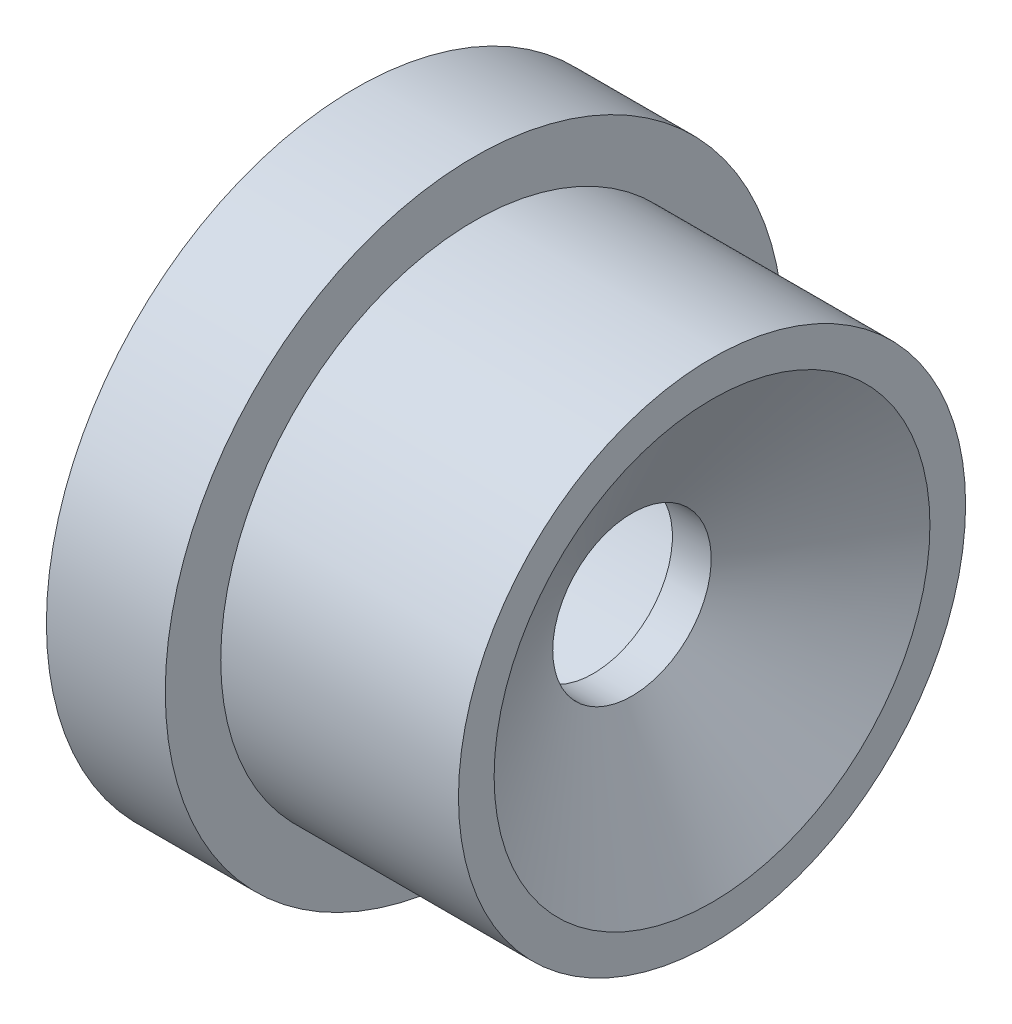
ISO-10303-21;
HEADER;
FILE_DESCRIPTION(('STEP AP214'),'2;1');
FILE_NAME('part.step','',(''),(''),'','','');
FILE_SCHEMA(('AUTOMOTIVE_DESIGN { 1 0 10303 214 1 1 1 1 }'));
ENDSEC;
DATA;
#1=APPLICATION_CONTEXT('core data for automotive mechanical design processes');
#2=APPLICATION_PROTOCOL_DEFINITION('international standard','automotive_design',2000,#1);
#3=PRODUCT_CONTEXT('',#1,'mechanical');
#4=PRODUCT('Part','Part','',(#3));
#5=PRODUCT_RELATED_PRODUCT_CATEGORY('part','',(#4));
#6=PRODUCT_DEFINITION_FORMATION('','',#4);
#7=PRODUCT_DEFINITION_CONTEXT('part definition',#1,'design');
#8=PRODUCT_DEFINITION('design','',#6,#7);
#9=PRODUCT_DEFINITION_SHAPE('','',#8);
#10=(LENGTH_UNIT() NAMED_UNIT(*) SI_UNIT(.MILLI.,.METRE.));
#11=(NAMED_UNIT(*) PLANE_ANGLE_UNIT() SI_UNIT($,.RADIAN.));
#12=(NAMED_UNIT(*) SI_UNIT($,.STERADIAN.) SOLID_ANGLE_UNIT());
#13=UNCERTAINTY_MEASURE_WITH_UNIT(LENGTH_MEASURE(1.E-05),#10,'distance_accuracy_value','');
#14=(GEOMETRIC_REPRESENTATION_CONTEXT(3) GLOBAL_UNCERTAINTY_ASSIGNED_CONTEXT((#13)) GLOBAL_UNIT_ASSIGNED_CONTEXT((#10,
#11,#12)) REPRESENTATION_CONTEXT('',''));
#15=CARTESIAN_POINT('',(0.,0.,0.));
#16=DIRECTION('',(0.,0.,1.));
#17=DIRECTION('',(1.,0.,0.));
#18=AXIS2_PLACEMENT_3D('',#15,#16,#17);
#19=CARTESIAN_POINT('',(0.,3.9,0.));
#20=DIRECTION('',(1.,0.,0.));
#21=DIRECTION('',(0.,0.,-1.));
#22=AXIS2_PLACEMENT_3D('',#19,#20,#21);
#23=PLANE('',#22);
#24=CARTESIAN_POINT('',(0.,0.,0.));
#25=DIRECTION('',(-1.,0.,0.));
#26=DIRECTION('',(0.,0.,1.));
#27=AXIS2_PLACEMENT_3D('',#24,#25,#26);
#28=CIRCLE('',#27,2.25);
#29=CARTESIAN_POINT('',(0.,0.,2.25));
#30=VERTEX_POINT('',#29);
#31=EDGE_CURVE('E10',#30,#30,#28,.T.);
#32=ORIENTED_EDGE('',*,*,#31,.F.);
#33=EDGE_LOOP('',(#32));
#34=FACE_BOUND('',#33,.T.);
#35=CARTESIAN_POINT('',(0.,0.,0.));
#36=DIRECTION('',(-1.,0.,0.));
#37=DIRECTION('',(0.,0.,1.));
#38=AXIS2_PLACEMENT_3D('',#35,#36,#37);
#39=CIRCLE('',#38,3.9);
#40=CARTESIAN_POINT('',(0.,0.,3.9));
#41=VERTEX_POINT('',#40);
#42=EDGE_CURVE('E64',#41,#41,#39,.T.);
#43=ORIENTED_EDGE('',*,*,#42,.T.);
#44=EDGE_LOOP('',(#43));
#45=FACE_BOUND('',#44,.T.);
#46=ADVANCED_FACE('F33',(#34,#45),#23,.F.);
#47=CARTESIAN_POINT('',(0.,0.,0.));
#48=DIRECTION('',(-1.,0.,0.));
#49=DIRECTION('',(0.,0.,1.));
#50=AXIS2_PLACEMENT_3D('',#47,#48,#49);
#51=CYLINDRICAL_SURFACE('',#50,2.25);
#52=CARTESIAN_POINT('',(3.,0.,0.));
#53=DIRECTION('',(-1.,0.,0.));
#54=DIRECTION('',(0.,0.,1.));
#55=AXIS2_PLACEMENT_3D('',#52,#53,#54);
#56=CIRCLE('',#55,2.25);
#57=CARTESIAN_POINT('',(3.,0.,2.25));
#58=VERTEX_POINT('',#57);
#59=EDGE_CURVE('E39',#58,#58,#56,.T.);
#60=ORIENTED_EDGE('',*,*,#59,.F.);
#61=EDGE_LOOP('',(#60));
#62=FACE_BOUND('',#61,.T.);
#63=ORIENTED_EDGE('',*,*,#31,.T.);
#64=EDGE_LOOP('',(#63));
#65=FACE_BOUND('',#64,.T.);
#66=ADVANCED_FACE('F107',(#62,#65),#51,.F.);
#67=CARTESIAN_POINT('',(3.,2.25,0.));
#68=DIRECTION('',(1.,0.,0.));
#69=DIRECTION('',(0.,0.,-1.));
#70=AXIS2_PLACEMENT_3D('',#67,#68,#69);
#71=PLANE('',#70);
#72=CARTESIAN_POINT('',(3.,0.,0.));
#73=DIRECTION('',(-1.,0.,0.));
#74=DIRECTION('',(0.,0.,1.));
#75=AXIS2_PLACEMENT_3D('',#72,#73,#74);
#76=CIRCLE('',#75,1.);
#77=CARTESIAN_POINT('',(3.,0.,1.));
#78=VERTEX_POINT('',#77);
#79=EDGE_CURVE('E43',#78,#78,#76,.T.);
#80=ORIENTED_EDGE('',*,*,#79,.F.);
#81=EDGE_LOOP('',(#80));
#82=FACE_BOUND('',#81,.T.);
#83=ORIENTED_EDGE('',*,*,#59,.T.);
#84=EDGE_LOOP('',(#83));
#85=FACE_BOUND('',#84,.T.);
#86=ADVANCED_FACE('F102',(#82,#85),#71,.F.);
#87=CARTESIAN_POINT('',(0.,0.,0.));
#88=DIRECTION('',(-1.,0.,0.));
#89=DIRECTION('',(0.,0.,1.));
#90=AXIS2_PLACEMENT_3D('',#87,#88,#89);
#91=CYLINDRICAL_SURFACE('',#90,1.);
#92=CARTESIAN_POINT('',(3.48963702891816,0.,0.));
#93=DIRECTION('',(-1.,0.,0.));
#94=DIRECTION('',(0.,0.,1.));
#95=AXIS2_PLACEMENT_3D('',#92,#93,#94);
#96=CIRCLE('',#95,1.);
#97=CARTESIAN_POINT('',(3.48963702891816,0.,1.));
#98=VERTEX_POINT('',#97);
#99=EDGE_CURVE('E47',#98,#98,#96,.T.);
#100=ORIENTED_EDGE('',*,*,#99,.F.);
#101=EDGE_LOOP('',(#100));
#102=FACE_BOUND('',#101,.T.);
#103=ORIENTED_EDGE('',*,*,#79,.T.);
#104=EDGE_LOOP('',(#103));
#105=FACE_BOUND('',#104,.T.);
#106=ADVANCED_FACE('F96',(#102,#105),#91,.F.);
#107=CARTESIAN_POINT('',(3.48963702891816,0.,0.));
#108=DIRECTION('',(1.,0.,0.));
#109=DIRECTION('',(0.,0.,-1.));
#110=AXIS2_PLACEMENT_3D('',#107,#108,#109);
#111=CONICAL_SURFACE('',#110,1.,1.0471975511966);
#112=CARTESIAN_POINT('',(4.5,0.,0.));
#113=DIRECTION('',(-1.,0.,0.));
#114=DIRECTION('',(0.,0.,1.));
#115=AXIS2_PLACEMENT_3D('',#112,#113,#114);
#116=CIRCLE('',#115,2.75);
#117=CARTESIAN_POINT('',(4.5,0.,2.75));
#118=VERTEX_POINT('',#117);
#119=EDGE_CURVE('E52',#118,#118,#116,.T.);
#120=ORIENTED_EDGE('',*,*,#119,.F.);
#121=EDGE_LOOP('',(#120));
#122=FACE_BOUND('',#121,.T.);
#123=ORIENTED_EDGE('',*,*,#99,.T.);
#124=EDGE_LOOP('',(#123));
#125=FACE_BOUND('',#124,.T.);
#126=ADVANCED_FACE('F90',(#122,#125),#111,.F.);
#127=CARTESIAN_POINT('',(4.5,2.75,0.));
#128=DIRECTION('',(-1.,0.,0.));
#129=DIRECTION('',(0.,0.,1.));
#130=AXIS2_PLACEMENT_3D('',#127,#128,#129);
#131=PLANE('',#130);
#132=CARTESIAN_POINT('',(4.5,0.,0.));
#133=DIRECTION('',(-1.,0.,0.));
#134=DIRECTION('',(0.,0.,1.));
#135=AXIS2_PLACEMENT_3D('',#132,#133,#134);
#136=CIRCLE('',#135,3.2);
#137=CARTESIAN_POINT('',(4.5,0.,3.2));
#138=VERTEX_POINT('',#137);
#139=EDGE_CURVE('E55',#138,#138,#136,.T.);
#140=ORIENTED_EDGE('',*,*,#139,.F.);
#141=EDGE_LOOP('',(#140));
#142=FACE_BOUND('',#141,.T.);
#143=ORIENTED_EDGE('',*,*,#119,.T.);
#144=EDGE_LOOP('',(#143));
#145=FACE_BOUND('',#144,.T.);
#146=ADVANCED_FACE('F84',(#142,#145),#131,.F.);
#147=CARTESIAN_POINT('',(0.,0.,0.));
#148=DIRECTION('',(-1.,0.,0.));
#149=DIRECTION('',(0.,0.,1.));
#150=AXIS2_PLACEMENT_3D('',#147,#148,#149);
#151=CYLINDRICAL_SURFACE('',#150,3.2);
#152=CARTESIAN_POINT('',(1.5,0.,0.));
#153=DIRECTION('',(-1.,0.,0.));
#154=DIRECTION('',(0.,0.,1.));
#155=AXIS2_PLACEMENT_3D('',#152,#153,#154);
#156=CIRCLE('',#155,3.2);
#157=CARTESIAN_POINT('',(1.5,0.,3.2));
#158=VERTEX_POINT('',#157);
#159=EDGE_CURVE('E58',#158,#158,#156,.T.);
#160=ORIENTED_EDGE('',*,*,#159,.F.);
#161=EDGE_LOOP('',(#160));
#162=FACE_BOUND('',#161,.T.);
#163=ORIENTED_EDGE('',*,*,#139,.T.);
#164=EDGE_LOOP('',(#163));
#165=FACE_BOUND('',#164,.T.);
#166=ADVANCED_FACE('F78',(#162,#165),#151,.T.);
#167=CARTESIAN_POINT('',(1.5,3.2,0.));
#168=DIRECTION('',(-1.,0.,0.));
#169=DIRECTION('',(0.,0.,1.));
#170=AXIS2_PLACEMENT_3D('',#167,#168,#169);
#171=PLANE('',#170);
#172=CARTESIAN_POINT('',(1.5,0.,0.));
#173=DIRECTION('',(-1.,0.,0.));
#174=DIRECTION('',(0.,0.,1.));
#175=AXIS2_PLACEMENT_3D('',#172,#173,#174);
#176=CIRCLE('',#175,3.9);
#177=CARTESIAN_POINT('',(1.5,0.,3.9));
#178=VERTEX_POINT('',#177);
#179=EDGE_CURVE('E61',#178,#178,#176,.T.);
#180=ORIENTED_EDGE('',*,*,#179,.F.);
#181=EDGE_LOOP('',(#180));
#182=FACE_BOUND('',#181,.T.);
#183=ORIENTED_EDGE('',*,*,#159,.T.);
#184=EDGE_LOOP('',(#183));
#185=FACE_BOUND('',#184,.T.);
#186=ADVANCED_FACE('F72',(#182,#185),#171,.F.);
#187=CARTESIAN_POINT('',(0.,0.,0.));
#188=DIRECTION('',(-1.,0.,0.));
#189=DIRECTION('',(0.,0.,1.));
#190=AXIS2_PLACEMENT_3D('',#187,#188,#189);
#191=CYLINDRICAL_SURFACE('',#190,3.9);
#192=ORIENTED_EDGE('',*,*,#42,.F.);
#193=EDGE_LOOP('',(#192));
#194=FACE_BOUND('',#193,.T.);
#195=ORIENTED_EDGE('',*,*,#179,.T.);
#196=EDGE_LOOP('',(#195));
#197=FACE_BOUND('',#196,.T.);
#198=ADVANCED_FACE('F69',(#194,#197),#191,.T.);
#199=CLOSED_SHELL('',(#46,#66,#86,#106,#126,#146,#166,#186,#198));
#200=MANIFOLD_SOLID_BREP('B2',#199);
#201=ADVANCED_BREP_SHAPE_REPRESENTATION('',(#18,#200),#14);
#202=SHAPE_DEFINITION_REPRESENTATION(#9,#201);
ENDSEC;
END-ISO-10303-21;
